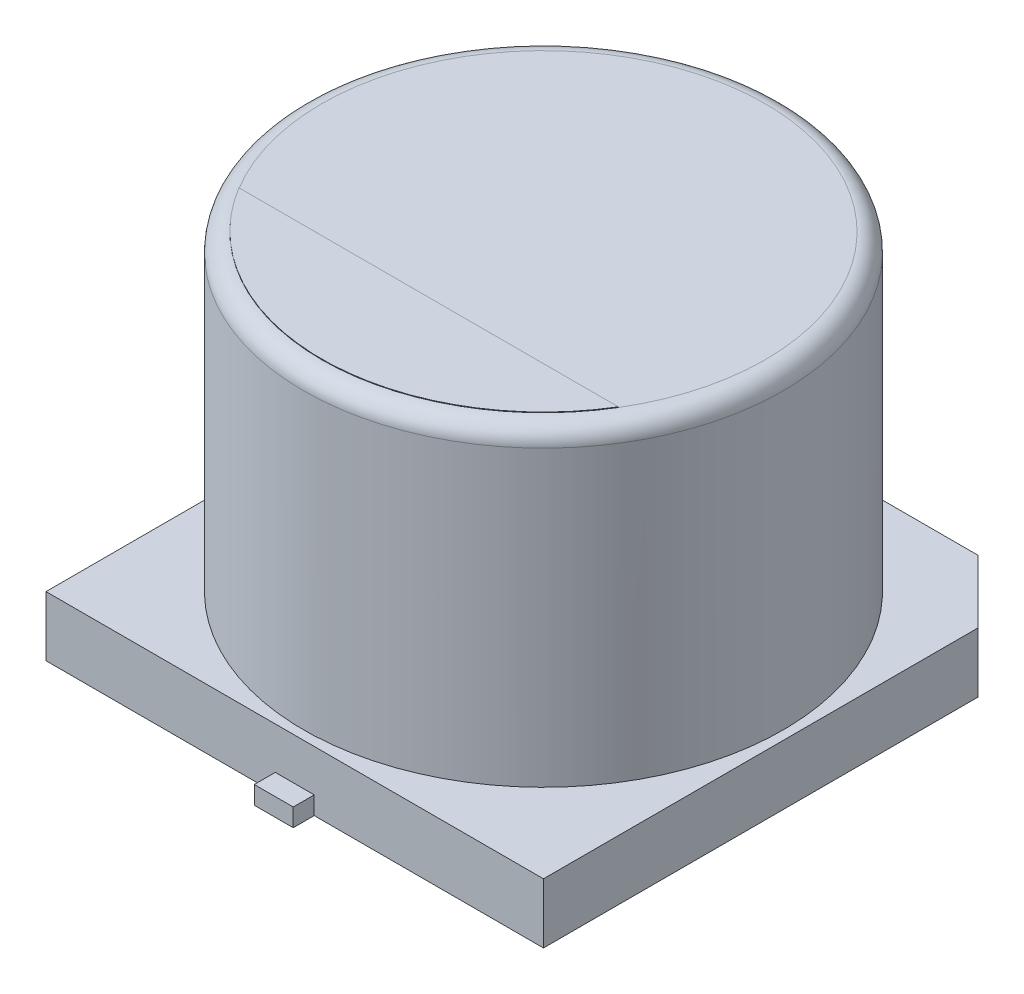
ISO-10303-21;
HEADER;
FILE_DESCRIPTION(('STEP AP214'),'2;1');
FILE_NAME('part.step','',(''),(''),'','','');
FILE_SCHEMA(('AUTOMOTIVE_DESIGN { 1 0 10303 214 1 1 1 1 }'));
ENDSEC;
DATA;
#1=APPLICATION_CONTEXT('core data for automotive mechanical design processes');
#2=APPLICATION_PROTOCOL_DEFINITION('international standard','automotive_design',2000,#1);
#3=PRODUCT_CONTEXT('',#1,'mechanical');
#4=PRODUCT('Part','Part','',(#3));
#5=PRODUCT_RELATED_PRODUCT_CATEGORY('part','',(#4));
#6=PRODUCT_DEFINITION_FORMATION('','',#4);
#7=PRODUCT_DEFINITION_CONTEXT('part definition',#1,'design');
#8=PRODUCT_DEFINITION('design','',#6,#7);
#9=PRODUCT_DEFINITION_SHAPE('','',#8);
#10=(LENGTH_UNIT() NAMED_UNIT(*) SI_UNIT(.MILLI.,.METRE.));
#11=(NAMED_UNIT(*) PLANE_ANGLE_UNIT() SI_UNIT($,.RADIAN.));
#12=(NAMED_UNIT(*) SI_UNIT($,.STERADIAN.) SOLID_ANGLE_UNIT());
#13=UNCERTAINTY_MEASURE_WITH_UNIT(LENGTH_MEASURE(1.E-05),#10,'distance_accuracy_value','');
#14=(GEOMETRIC_REPRESENTATION_CONTEXT(3) GLOBAL_UNCERTAINTY_ASSIGNED_CONTEXT((#13)) GLOBAL_UNIT_ASSIGNED_CONTEXT((#10,
#11,#12)) REPRESENTATION_CONTEXT('',''));
#15=CARTESIAN_POINT('',(0.,0.,0.));
#16=DIRECTION('',(0.,0.,1.));
#17=DIRECTION('',(1.,0.,0.));
#18=AXIS2_PLACEMENT_3D('',#15,#16,#17);
#19=CARTESIAN_POINT('',(0.,6.2,0.));
#20=DIRECTION('',(0.,1.,0.));
#21=DIRECTION('',(0.,0.,1.));
#22=AXIS2_PLACEMENT_3D('',#19,#20,#21);
#23=PLANE('',#22);
#24=CARTESIAN_POINT('',(0.,6.2,0.));
#25=DIRECTION('',(0.,1.,0.));
#26=DIRECTION('',(0.,0.,1.));
#27=AXIS2_PLACEMENT_3D('',#24,#25,#26);
#28=CIRCLE('',#27,3.7);
#29=CARTESIAN_POINT('',(3.16503381707792,6.2,1.91639268855659));
#30=VERTEX_POINT('',#29);
#31=CARTESIAN_POINT('',(-3.16503381707792,6.2,1.91639268855659));
#32=VERTEX_POINT('',#31);
#33=EDGE_CURVE('E221',#30,#32,#28,.T.);
#34=ORIENTED_EDGE('',*,*,#33,.T.);
#35=DIRECTION('',(-1.,0.,0.));
#36=VECTOR('',#35,1.);
#37=CARTESIAN_POINT('',(-3.16503381707792,6.2,1.91639268855659));
#38=LINE('',#37,#36);
#39=EDGE_CURVE('E159',#30,#32,#38,.T.);
#40=ORIENTED_EDGE('',*,*,#39,.F.);
#41=EDGE_LOOP('',(#34,#40));
#42=FACE_BOUND('',#41,.T.);
#43=ADVANCED_FACE('F33',(#42),#23,.T.);
#44=CARTESIAN_POINT('',(-3.1,1.,-4.15));
#45=DIRECTION('',(0.,0.,1.));
#46=DIRECTION('',(1.,0.,0.));
#47=AXIS2_PLACEMENT_3D('',#44,#45,#46);
#48=PLANE('',#47);
#49=DIRECTION('',(0.,-1.,0.));
#50=VECTOR('',#49,1.);
#51=CARTESIAN_POINT('',(0.325,1.,-4.15));
#52=LINE('',#51,#50);
#53=CARTESIAN_POINT('',(0.325,0.3,-4.15));
#54=VERTEX_POINT('',#53);
#55=CARTESIAN_POINT('',(0.324999999999999,0.,-4.15));
#56=VERTEX_POINT('',#55);
#57=EDGE_CURVE('E188',#54,#56,#52,.T.);
#58=ORIENTED_EDGE('',*,*,#57,.F.);
#59=DIRECTION('',(-1.,0.,0.));
#60=VECTOR('',#59,1.);
#61=CARTESIAN_POINT('',(-3.1,0.3,-4.15));
#62=LINE('',#61,#60);
#63=CARTESIAN_POINT('',(-0.325,0.3,-4.15));
#64=VERTEX_POINT('',#63);
#65=EDGE_CURVE('E11',#54,#64,#62,.T.);
#66=ORIENTED_EDGE('',*,*,#65,.T.);
#67=DIRECTION('',(0.,1.,0.));
#68=VECTOR('',#67,1.);
#69=CARTESIAN_POINT('',(-0.325,1.,-4.15));
#70=LINE('',#69,#68);
#71=CARTESIAN_POINT('',(-0.325,0.,-4.15));
#72=VERTEX_POINT('',#71);
#73=EDGE_CURVE('E186',#72,#64,#70,.T.);
#74=ORIENTED_EDGE('',*,*,#73,.F.);
#75=DIRECTION('',(-1.,0.,0.));
#76=VECTOR('',#75,1.);
#77=CARTESIAN_POINT('',(-3.1,0.,-4.15));
#78=LINE('',#77,#76);
#79=CARTESIAN_POINT('',(-3.1,0.,-4.15));
#80=VERTEX_POINT('',#79);
#81=EDGE_CURVE('E242',#72,#80,#78,.T.);
#82=ORIENTED_EDGE('',*,*,#81,.T.);
#83=DIRECTION('',(0.,-1.,0.));
#84=VECTOR('',#83,1.);
#85=CARTESIAN_POINT('',(-3.1,1.,-4.15));
#86=LINE('',#85,#84);
#87=CARTESIAN_POINT('',(-3.1,1.,-4.15));
#88=VERTEX_POINT('',#87);
#89=EDGE_CURVE('E259',#88,#80,#86,.T.);
#90=ORIENTED_EDGE('',*,*,#89,.F.);
#91=DIRECTION('',(-1.,0.,0.));
#92=VECTOR('',#91,1.);
#93=CARTESIAN_POINT('',(-3.1,1.,-4.15));
#94=LINE('',#93,#92);
#95=CARTESIAN_POINT('',(3.1,1.,-4.15));
#96=VERTEX_POINT('',#95);
#97=EDGE_CURVE('E229',#96,#88,#94,.T.);
#98=ORIENTED_EDGE('',*,*,#97,.F.);
#99=DIRECTION('',(0.,-1.,0.));
#100=VECTOR('',#99,1.);
#101=CARTESIAN_POINT('',(3.1,1.,-4.15));
#102=LINE('',#101,#100);
#103=CARTESIAN_POINT('',(3.1,0.,-4.15));
#104=VERTEX_POINT('',#103);
#105=EDGE_CURVE('E262',#96,#104,#102,.T.);
#106=ORIENTED_EDGE('',*,*,#105,.T.);
#107=EDGE_CURVE('E243',#104,#56,#78,.T.);
#108=ORIENTED_EDGE('',*,*,#107,.T.);
#109=EDGE_LOOP('',(#58,#66,#74,#82,#90,#98,#106,#108));
#110=FACE_BOUND('',#109,.T.);
#111=ADVANCED_FACE('F319',(#110),#48,.F.);
#112=CARTESIAN_POINT('',(4.15,1.,4.15));
#113=DIRECTION('',(0.,0.,-1.));
#114=DIRECTION('',(-1.,0.,0.));
#115=AXIS2_PLACEMENT_3D('',#112,#113,#114);
#116=PLANE('',#115);
#117=DIRECTION('',(0.,-1.,0.));
#118=VECTOR('',#117,1.);
#119=CARTESIAN_POINT('',(-0.325000000000001,1.,4.15));
#120=LINE('',#119,#118);
#121=CARTESIAN_POINT('',(-0.325000000000001,0.3,4.15));
#122=VERTEX_POINT('',#121);
#123=CARTESIAN_POINT('',(-0.324999999999998,0.,4.15));
#124=VERTEX_POINT('',#123);
#125=EDGE_CURVE('E214',#122,#124,#120,.T.);
#126=ORIENTED_EDGE('',*,*,#125,.F.);
#127=DIRECTION('',(-1.,0.,0.));
#128=VECTOR('',#127,1.);
#129=CARTESIAN_POINT('',(4.15,0.3,4.15));
#130=LINE('',#129,#128);
#131=CARTESIAN_POINT('',(0.325,0.3,4.15));
#132=VERTEX_POINT('',#131);
#133=EDGE_CURVE('E41',#132,#122,#130,.T.);
#134=ORIENTED_EDGE('',*,*,#133,.F.);
#135=DIRECTION('',(0.,1.,0.));
#136=VECTOR('',#135,1.);
#137=CARTESIAN_POINT('',(0.325,1.,4.15));
#138=LINE('',#137,#136);
#139=CARTESIAN_POINT('',(0.325,0.,4.15));
#140=VERTEX_POINT('',#139);
#141=EDGE_CURVE('E211',#140,#132,#138,.T.);
#142=ORIENTED_EDGE('',*,*,#141,.F.);
#143=DIRECTION('',(1.,0.,0.));
#144=VECTOR('',#143,1.);
#145=CARTESIAN_POINT('',(4.15,0.,4.15));
#146=LINE('',#145,#144);
#147=CARTESIAN_POINT('',(4.15,0.,4.15));
#148=VERTEX_POINT('',#147);
#149=EDGE_CURVE('E249',#140,#148,#146,.T.);
#150=ORIENTED_EDGE('',*,*,#149,.T.);
#151=DIRECTION('',(0.,-1.,0.));
#152=VECTOR('',#151,1.);
#153=CARTESIAN_POINT('',(4.15,1.,4.15));
#154=LINE('',#153,#152);
#155=CARTESIAN_POINT('',(4.15,1.,4.15));
#156=VERTEX_POINT('',#155);
#157=EDGE_CURVE('E237',#156,#148,#154,.T.);
#158=ORIENTED_EDGE('',*,*,#157,.F.);
#159=DIRECTION('',(1.,0.,0.));
#160=VECTOR('',#159,1.);
#161=CARTESIAN_POINT('',(4.15,1.,4.15));
#162=LINE('',#161,#160);
#163=CARTESIAN_POINT('',(-4.15,1.,4.15));
#164=VERTEX_POINT('',#163);
#165=EDGE_CURVE('E235',#164,#156,#162,.T.);
#166=ORIENTED_EDGE('',*,*,#165,.F.);
#167=DIRECTION('',(0.,-1.,0.));
#168=VECTOR('',#167,1.);
#169=CARTESIAN_POINT('',(-4.15,1.,4.15));
#170=LINE('',#169,#168);
#171=CARTESIAN_POINT('',(-4.15,0.,4.15));
#172=VERTEX_POINT('',#171);
#173=EDGE_CURVE('E253',#164,#172,#170,.T.);
#174=ORIENTED_EDGE('',*,*,#173,.T.);
#175=EDGE_CURVE('E227',#172,#124,#146,.T.);
#176=ORIENTED_EDGE('',*,*,#175,.T.);
#177=EDGE_LOOP('',(#126,#134,#142,#150,#158,#166,#174,#176));
#178=FACE_BOUND('',#177,.T.);
#179=ADVANCED_FACE('F289',(#178),#116,.F.);
#180=CARTESIAN_POINT('',(4.15,1.,-3.1));
#181=DIRECTION('',(-1.,0.,0.));
#182=DIRECTION('',(0.,0.,1.));
#183=AXIS2_PLACEMENT_3D('',#180,#181,#182);
#184=PLANE('',#183);
#185=DIRECTION('',(0.,0.,-1.));
#186=VECTOR('',#185,1.);
#187=CARTESIAN_POINT('',(4.15,0.,-3.1));
#188=LINE('',#187,#186);
#189=CARTESIAN_POINT('',(4.15,0.,-3.1));
#190=VERTEX_POINT('',#189);
#191=EDGE_CURVE('E217',#148,#190,#188,.T.);
#192=ORIENTED_EDGE('',*,*,#191,.T.);
#193=DIRECTION('',(0.,-1.,0.));
#194=VECTOR('',#193,1.);
#195=CARTESIAN_POINT('',(4.15,1.,-3.1));
#196=LINE('',#195,#194);
#197=CARTESIAN_POINT('',(4.15,1.,-3.1));
#198=VERTEX_POINT('',#197);
#199=EDGE_CURVE('E222',#198,#190,#196,.T.);
#200=ORIENTED_EDGE('',*,*,#199,.F.);
#201=DIRECTION('',(0.,0.,-1.));
#202=VECTOR('',#201,1.);
#203=CARTESIAN_POINT('',(4.15,1.,-3.1));
#204=LINE('',#203,#202);
#205=EDGE_CURVE('E223',#156,#198,#204,.T.);
#206=ORIENTED_EDGE('',*,*,#205,.F.);
#207=ORIENTED_EDGE('',*,*,#157,.T.);
#208=EDGE_LOOP('',(#192,#200,#206,#207));
#209=FACE_BOUND('',#208,.T.);
#210=ADVANCED_FACE('F296',(#209),#184,.F.);
#211=CARTESIAN_POINT('',(3.1,1.,-4.15));
#212=DIRECTION('',(-0.707106781186548,0.,0.707106781186547));
#213=DIRECTION('',(0.707106781186547,0.,0.707106781186548));
#214=AXIS2_PLACEMENT_3D('',#211,#212,#213);
#215=PLANE('',#214);
#216=DIRECTION('',(-0.707106781186547,0.,-0.707106781186548));
#217=VECTOR('',#216,1.);
#218=CARTESIAN_POINT('',(3.1,0.,-4.15));
#219=LINE('',#218,#217);
#220=EDGE_CURVE('E240',#190,#104,#219,.T.);
#221=ORIENTED_EDGE('',*,*,#220,.T.);
#222=ORIENTED_EDGE('',*,*,#105,.F.);
#223=DIRECTION('',(-0.707106781186547,0.,-0.707106781186548));
#224=VECTOR('',#223,1.);
#225=CARTESIAN_POINT('',(3.1,1.,-4.15));
#226=LINE('',#225,#224);
#227=EDGE_CURVE('E226',#198,#96,#226,.T.);
#228=ORIENTED_EDGE('',*,*,#227,.F.);
#229=ORIENTED_EDGE('',*,*,#199,.T.);
#230=EDGE_LOOP('',(#221,#222,#228,#229));
#231=FACE_BOUND('',#230,.T.);
#232=ADVANCED_FACE('F303',(#231),#215,.F.);
#233=CARTESIAN_POINT('',(-4.15,1.,-3.1));
#234=DIRECTION('',(0.707106781186548,0.,0.707106781186547));
#235=DIRECTION('',(0.707106781186547,0.,-0.707106781186548));
#236=AXIS2_PLACEMENT_3D('',#233,#234,#235);
#237=PLANE('',#236);
#238=DIRECTION('',(-0.707106781186547,0.,0.707106781186548));
#239=VECTOR('',#238,1.);
#240=CARTESIAN_POINT('',(-4.15,0.,-3.1));
#241=LINE('',#240,#239);
#242=CARTESIAN_POINT('',(-4.15,0.,-3.1));
#243=VERTEX_POINT('',#242);
#244=EDGE_CURVE('E245',#80,#243,#241,.T.);
#245=ORIENTED_EDGE('',*,*,#244,.T.);
#246=DIRECTION('',(0.,-1.,0.));
#247=VECTOR('',#246,1.);
#248=CARTESIAN_POINT('',(-4.15,1.,-3.1));
#249=LINE('',#248,#247);
#250=CARTESIAN_POINT('',(-4.15,1.,-3.1));
#251=VERTEX_POINT('',#250);
#252=EDGE_CURVE('E256',#251,#243,#249,.T.);
#253=ORIENTED_EDGE('',*,*,#252,.F.);
#254=DIRECTION('',(-0.707106781186547,0.,0.707106781186548));
#255=VECTOR('',#254,1.);
#256=CARTESIAN_POINT('',(-4.15,1.,-3.1));
#257=LINE('',#256,#255);
#258=EDGE_CURVE('E231',#88,#251,#257,.T.);
#259=ORIENTED_EDGE('',*,*,#258,.F.);
#260=ORIENTED_EDGE('',*,*,#89,.T.);
#261=EDGE_LOOP('',(#245,#253,#259,#260));
#262=FACE_BOUND('',#261,.T.);
#263=ADVANCED_FACE('F317',(#262),#237,.F.);
#264=CARTESIAN_POINT('',(-4.15,1.,4.15));
#265=DIRECTION('',(1.,0.,0.));
#266=DIRECTION('',(0.,0.,-1.));
#267=AXIS2_PLACEMENT_3D('',#264,#265,#266);
#268=PLANE('',#267);
#269=DIRECTION('',(0.,0.,1.));
#270=VECTOR('',#269,1.);
#271=CARTESIAN_POINT('',(-4.15,0.,4.15));
#272=LINE('',#271,#270);
#273=EDGE_CURVE('E247',#243,#172,#272,.T.);
#274=ORIENTED_EDGE('',*,*,#273,.T.);
#275=ORIENTED_EDGE('',*,*,#173,.F.);
#276=DIRECTION('',(0.,0.,1.));
#277=VECTOR('',#276,1.);
#278=CARTESIAN_POINT('',(-4.15,1.,4.15));
#279=LINE('',#278,#277);
#280=EDGE_CURVE('E233',#251,#164,#279,.T.);
#281=ORIENTED_EDGE('',*,*,#280,.F.);
#282=ORIENTED_EDGE('',*,*,#252,.T.);
#283=EDGE_LOOP('',(#274,#275,#281,#282));
#284=FACE_BOUND('',#283,.T.);
#285=ADVANCED_FACE('F313',(#284),#268,.F.);
#286=CARTESIAN_POINT('',(0.,1.,0.));
#287=DIRECTION('',(0.,-1.,0.));
#288=DIRECTION('',(0.,0.,-1.));
#289=AXIS2_PLACEMENT_3D('',#286,#287,#288);
#290=PLANE('',#289);
#291=CARTESIAN_POINT('',(0.,1.,0.));
#292=DIRECTION('',(0.,-1.,0.));
#293=DIRECTION('',(0.,0.,-1.));
#294=AXIS2_PLACEMENT_3D('',#291,#292,#293);
#295=CIRCLE('',#294,4.);
#296=CARTESIAN_POINT('',(0.,1.,-4.));
#297=VERTEX_POINT('',#296);
#298=EDGE_CURVE('E218',#297,#297,#295,.F.);
#299=ORIENTED_EDGE('',*,*,#298,.F.);
#300=EDGE_LOOP('',(#299));
#301=FACE_BOUND('',#300,.T.);
#302=ORIENTED_EDGE('',*,*,#205,.T.);
#303=ORIENTED_EDGE('',*,*,#227,.T.);
#304=ORIENTED_EDGE('',*,*,#97,.T.);
#305=ORIENTED_EDGE('',*,*,#258,.T.);
#306=ORIENTED_EDGE('',*,*,#280,.T.);
#307=ORIENTED_EDGE('',*,*,#165,.T.);
#308=EDGE_LOOP('',(#302,#303,#304,#305,#306,#307));
#309=FACE_BOUND('',#308,.T.);
#310=ADVANCED_FACE('F306',(#301,#309),#290,.F.);
#311=CARTESIAN_POINT('',(0.,0.,0.));
#312=DIRECTION('',(0.,-1.,0.));
#313=DIRECTION('',(0.,0.,-1.));
#314=AXIS2_PLACEMENT_3D('',#311,#312,#313);
#315=PLANE('',#314);
#316=ORIENTED_EDGE('',*,*,#81,.F.);
#317=DIRECTION('',(0.,0.,1.));
#318=VECTOR('',#317,1.);
#319=CARTESIAN_POINT('',(-0.325,0.,-1.1));
#320=LINE('',#319,#318);
#321=CARTESIAN_POINT('',(-0.325,0.,-4.5));
#322=VERTEX_POINT('',#321);
#323=EDGE_CURVE('E172',#322,#72,#320,.T.);
#324=ORIENTED_EDGE('',*,*,#323,.F.);
#325=DIRECTION('',(-1.,0.,0.));
#326=VECTOR('',#325,1.);
#327=CARTESIAN_POINT('',(0.325,0.,-4.5));
#328=LINE('',#327,#326);
#329=CARTESIAN_POINT('',(0.325,0.,-4.5));
#330=VERTEX_POINT('',#329);
#331=EDGE_CURVE('E164',#330,#322,#328,.T.);
#332=ORIENTED_EDGE('',*,*,#331,.F.);
#333=DIRECTION('',(0.,0.,-1.));
#334=VECTOR('',#333,1.);
#335=CARTESIAN_POINT('',(0.325,0.,-1.1));
#336=LINE('',#335,#334);
#337=EDGE_CURVE('E162',#56,#330,#336,.T.);
#338=ORIENTED_EDGE('',*,*,#337,.F.);
#339=ORIENTED_EDGE('',*,*,#107,.F.);
#340=ORIENTED_EDGE('',*,*,#220,.F.);
#341=ORIENTED_EDGE('',*,*,#191,.F.);
#342=ORIENTED_EDGE('',*,*,#149,.F.);
#343=DIRECTION('',(0.,0.,-1.));
#344=VECTOR('',#343,1.);
#345=CARTESIAN_POINT('',(0.325,0.,1.1));
#346=LINE('',#345,#344);
#347=CARTESIAN_POINT('',(0.325,0.,4.5));
#348=VERTEX_POINT('',#347);
#349=EDGE_CURVE('E195',#348,#140,#346,.T.);
#350=ORIENTED_EDGE('',*,*,#349,.F.);
#351=DIRECTION('',(1.,0.,0.));
#352=VECTOR('',#351,1.);
#353=CARTESIAN_POINT('',(0.325,0.,4.5));
#354=LINE('',#353,#352);
#355=CARTESIAN_POINT('',(-0.325,0.,4.5));
#356=VERTEX_POINT('',#355);
#357=EDGE_CURVE('E202',#356,#348,#354,.T.);
#358=ORIENTED_EDGE('',*,*,#357,.F.);
#359=DIRECTION('',(0.,0.,1.));
#360=VECTOR('',#359,1.);
#361=CARTESIAN_POINT('',(-0.325,0.,1.1));
#362=LINE('',#361,#360);
#363=EDGE_CURVE('E191',#124,#356,#362,.T.);
#364=ORIENTED_EDGE('',*,*,#363,.F.);
#365=ORIENTED_EDGE('',*,*,#175,.F.);
#366=ORIENTED_EDGE('',*,*,#273,.F.);
#367=ORIENTED_EDGE('',*,*,#244,.F.);
#368=EDGE_LOOP('',(#316,#324,#332,#338,#339,#340,#341,#342,#350,#358,#364,#365,#366,#367));
#369=FACE_BOUND('',#368,.T.);
#370=ADVANCED_FACE('F298',(#369),#315,.T.);
#371=CARTESIAN_POINT('',(0.,6.2,0.));
#372=DIRECTION('',(0.,-1.,0.));
#373=DIRECTION('',(0.,0.,-1.));
#374=AXIS2_PLACEMENT_3D('',#371,#372,#373);
#375=CYLINDRICAL_SURFACE('',#374,4.);
#376=CARTESIAN_POINT('',(0.,5.9,0.));
#377=DIRECTION('',(0.,1.,0.));
#378=DIRECTION('',(0.,0.,1.));
#379=AXIS2_PLACEMENT_3D('',#376,#377,#378);
#380=CIRCLE('',#379,4.);
#381=CARTESIAN_POINT('',(0.,5.9,4.));
#382=VERTEX_POINT('',#381);
#383=EDGE_CURVE('E268',#382,#382,#380,.F.);
#384=ORIENTED_EDGE('',*,*,#383,.T.);
#385=EDGE_LOOP('',(#384));
#386=FACE_BOUND('',#385,.T.);
#387=ORIENTED_EDGE('',*,*,#298,.T.);
#388=EDGE_LOOP('',(#387));
#389=FACE_BOUND('',#388,.T.);
#390=ADVANCED_FACE('F354',(#386,#389),#375,.T.);
#391=CARTESIAN_POINT('',(0.,5.9,0.));
#392=DIRECTION('',(0.,1.,0.));
#393=DIRECTION('',(0.,0.,1.));
#394=AXIS2_PLACEMENT_3D('',#391,#392,#393);
#395=TOROIDAL_SURFACE('',#394,3.7,0.3);
#396=ORIENTED_EDGE('',*,*,#383,.F.);
#397=EDGE_LOOP('',(#396));
#398=FACE_BOUND('',#397,.T.);
#399=ORIENTED_EDGE('',*,*,#33,.F.);
#400=CARTESIAN_POINT('',(0.,6.2,0.));
#401=DIRECTION('',(0.,1.,0.));
#402=DIRECTION('',(0.,0.,1.));
#403=AXIS2_PLACEMENT_3D('',#400,#401,#402);
#404=CIRCLE('',#403,3.7);
#405=EDGE_CURVE('E47',#32,#30,#404,.T.);
#406=ORIENTED_EDGE('',*,*,#405,.F.);
#407=EDGE_LOOP('',(#399,#406));
#408=FACE_BOUND('',#407,.T.);
#409=ADVANCED_FACE('F35',(#398,#408),#395,.T.);
#410=CARTESIAN_POINT('',(0.,0.3,0.));
#411=DIRECTION('',(0.,-1.,0.));
#412=DIRECTION('',(0.,0.,-1.));
#413=AXIS2_PLACEMENT_3D('',#410,#411,#412);
#414=PLANE('',#413);
#415=DIRECTION('',(0.,0.,-1.));
#416=VECTOR('',#415,1.);
#417=CARTESIAN_POINT('',(0.325,0.3,1.1));
#418=LINE('',#417,#416);
#419=CARTESIAN_POINT('',(0.325,0.3,4.5));
#420=VERTEX_POINT('',#419);
#421=EDGE_CURVE('E197',#420,#132,#418,.T.);
#422=ORIENTED_EDGE('',*,*,#421,.T.);
#423=ORIENTED_EDGE('',*,*,#133,.T.);
#424=DIRECTION('',(0.,0.,1.));
#425=VECTOR('',#424,1.);
#426=CARTESIAN_POINT('',(-0.325,0.3,1.1));
#427=LINE('',#426,#425);
#428=CARTESIAN_POINT('',(-0.325,0.3,4.5));
#429=VERTEX_POINT('',#428);
#430=EDGE_CURVE('E192',#122,#429,#427,.T.);
#431=ORIENTED_EDGE('',*,*,#430,.T.);
#432=DIRECTION('',(1.,0.,0.));
#433=VECTOR('',#432,1.);
#434=CARTESIAN_POINT('',(0.325,0.3,4.5));
#435=LINE('',#434,#433);
#436=EDGE_CURVE('E194',#429,#420,#435,.T.);
#437=ORIENTED_EDGE('',*,*,#436,.T.);
#438=EDGE_LOOP('',(#422,#423,#431,#437));
#439=FACE_BOUND('',#438,.T.);
#440=ADVANCED_FACE('F273',(#439),#414,.F.);
#441=CARTESIAN_POINT('',(-0.325,0.3,1.1));
#442=DIRECTION('',(1.,0.,0.));
#443=DIRECTION('',(0.,0.,-1.));
#444=AXIS2_PLACEMENT_3D('',#441,#442,#443);
#445=PLANE('',#444);
#446=ORIENTED_EDGE('',*,*,#430,.F.);
#447=ORIENTED_EDGE('',*,*,#125,.T.);
#448=ORIENTED_EDGE('',*,*,#363,.T.);
#449=DIRECTION('',(0.,-1.,0.));
#450=VECTOR('',#449,1.);
#451=CARTESIAN_POINT('',(-0.325,0.3,4.5));
#452=LINE('',#451,#450);
#453=EDGE_CURVE('E208',#429,#356,#452,.T.);
#454=ORIENTED_EDGE('',*,*,#453,.F.);
#455=EDGE_LOOP('',(#446,#447,#448,#454));
#456=FACE_BOUND('',#455,.T.);
#457=ADVANCED_FACE('F280',(#456),#445,.F.);
#458=CARTESIAN_POINT('',(0.325,0.3,1.1));
#459=DIRECTION('',(-1.,0.,0.));
#460=DIRECTION('',(0.,0.,1.));
#461=AXIS2_PLACEMENT_3D('',#458,#459,#460);
#462=PLANE('',#461);
#463=ORIENTED_EDGE('',*,*,#349,.T.);
#464=ORIENTED_EDGE('',*,*,#141,.T.);
#465=ORIENTED_EDGE('',*,*,#421,.F.);
#466=DIRECTION('',(0.,-1.,0.));
#467=VECTOR('',#466,1.);
#468=CARTESIAN_POINT('',(0.325,0.3,4.5));
#469=LINE('',#468,#467);
#470=EDGE_CURVE('E200',#420,#348,#469,.T.);
#471=ORIENTED_EDGE('',*,*,#470,.T.);
#472=EDGE_LOOP('',(#463,#464,#465,#471));
#473=FACE_BOUND('',#472,.T.);
#474=ADVANCED_FACE('F288',(#473),#462,.F.);
#475=CARTESIAN_POINT('',(0.325,0.3,4.5));
#476=DIRECTION('',(0.,0.,-1.));
#477=DIRECTION('',(-1.,0.,0.));
#478=AXIS2_PLACEMENT_3D('',#475,#476,#477);
#479=PLANE('',#478);
#480=ORIENTED_EDGE('',*,*,#357,.T.);
#481=ORIENTED_EDGE('',*,*,#470,.F.);
#482=ORIENTED_EDGE('',*,*,#436,.F.);
#483=ORIENTED_EDGE('',*,*,#453,.T.);
#484=EDGE_LOOP('',(#480,#481,#482,#483));
#485=FACE_BOUND('',#484,.T.);
#486=ADVANCED_FACE('F284',(#485),#479,.F.);
#487=CARTESIAN_POINT('',(0.,0.3,0.));
#488=DIRECTION('',(0.,1.,0.));
#489=DIRECTION('',(0.,0.,1.));
#490=AXIS2_PLACEMENT_3D('',#487,#488,#489);
#491=PLANE('',#490);
#492=ORIENTED_EDGE('',*,*,#65,.F.);
#493=DIRECTION('',(0.,0.,-1.));
#494=VECTOR('',#493,1.);
#495=CARTESIAN_POINT('',(0.325,0.3,-1.1));
#496=LINE('',#495,#494);
#497=CARTESIAN_POINT('',(0.325,0.3,-4.5));
#498=VERTEX_POINT('',#497);
#499=EDGE_CURVE('E169',#54,#498,#496,.T.);
#500=ORIENTED_EDGE('',*,*,#499,.T.);
#501=DIRECTION('',(-1.,0.,0.));
#502=VECTOR('',#501,1.);
#503=CARTESIAN_POINT('',(0.325,0.3,-4.5));
#504=LINE('',#503,#502);
#505=CARTESIAN_POINT('',(-0.325,0.3,-4.5));
#506=VERTEX_POINT('',#505);
#507=EDGE_CURVE('E171',#498,#506,#504,.T.);
#508=ORIENTED_EDGE('',*,*,#507,.T.);
#509=DIRECTION('',(0.,0.,1.));
#510=VECTOR('',#509,1.);
#511=CARTESIAN_POINT('',(-0.325,0.3,-1.1));
#512=LINE('',#511,#510);
#513=EDGE_CURVE('E174',#506,#64,#512,.T.);
#514=ORIENTED_EDGE('',*,*,#513,.T.);
#515=EDGE_LOOP('',(#492,#500,#508,#514));
#516=FACE_BOUND('',#515,.T.);
#517=ADVANCED_FACE('F334',(#516),#491,.T.);
#518=CARTESIAN_POINT('',(0.325,0.3,-1.1));
#519=DIRECTION('',(-1.,0.,0.));
#520=DIRECTION('',(0.,0.,1.));
#521=AXIS2_PLACEMENT_3D('',#518,#519,#520);
#522=PLANE('',#521);
#523=ORIENTED_EDGE('',*,*,#499,.F.);
#524=ORIENTED_EDGE('',*,*,#57,.T.);
#525=ORIENTED_EDGE('',*,*,#337,.T.);
#526=DIRECTION('',(0.,-1.,0.));
#527=VECTOR('',#526,1.);
#528=CARTESIAN_POINT('',(0.325,0.3,-4.5));
#529=LINE('',#528,#527);
#530=EDGE_CURVE('E183',#498,#330,#529,.T.);
#531=ORIENTED_EDGE('',*,*,#530,.F.);
#532=EDGE_LOOP('',(#523,#524,#525,#531));
#533=FACE_BOUND('',#532,.T.);
#534=ADVANCED_FACE('F332',(#533),#522,.F.);
#535=CARTESIAN_POINT('',(-0.325,0.3,-1.1));
#536=DIRECTION('',(1.,0.,0.));
#537=DIRECTION('',(0.,0.,-1.));
#538=AXIS2_PLACEMENT_3D('',#535,#536,#537);
#539=PLANE('',#538);
#540=ORIENTED_EDGE('',*,*,#323,.T.);
#541=ORIENTED_EDGE('',*,*,#73,.T.);
#542=ORIENTED_EDGE('',*,*,#513,.F.);
#543=DIRECTION('',(0.,-1.,0.));
#544=VECTOR('',#543,1.);
#545=CARTESIAN_POINT('',(-0.325,0.3,-4.5));
#546=LINE('',#545,#544);
#547=EDGE_CURVE('E176',#506,#322,#546,.T.);
#548=ORIENTED_EDGE('',*,*,#547,.T.);
#549=EDGE_LOOP('',(#540,#541,#542,#548));
#550=FACE_BOUND('',#549,.T.);
#551=ADVANCED_FACE('F323',(#550),#539,.F.);
#552=CARTESIAN_POINT('',(0.325,0.3,-4.5));
#553=DIRECTION('',(0.,0.,1.));
#554=DIRECTION('',(1.,0.,0.));
#555=AXIS2_PLACEMENT_3D('',#552,#553,#554);
#556=PLANE('',#555);
#557=ORIENTED_EDGE('',*,*,#331,.T.);
#558=ORIENTED_EDGE('',*,*,#547,.F.);
#559=ORIENTED_EDGE('',*,*,#507,.F.);
#560=ORIENTED_EDGE('',*,*,#530,.T.);
#561=EDGE_LOOP('',(#557,#558,#559,#560));
#562=FACE_BOUND('',#561,.T.);
#563=ADVANCED_FACE('F328',(#562),#556,.F.);
#564=CARTESIAN_POINT('',(0.,6.21,0.));
#565=DIRECTION('',(0.,-1.,0.));
#566=DIRECTION('',(0.,0.,-1.));
#567=AXIS2_PLACEMENT_3D('',#564,#565,#566);
#568=CYLINDRICAL_SURFACE('',#567,3.7);
#569=ORIENTED_EDGE('',*,*,#405,.T.);
#570=DIRECTION('',(0.,-1.,0.));
#571=VECTOR('',#570,1.);
#572=CARTESIAN_POINT('',(3.16503381707792,6.21,1.91639268855659));
#573=LINE('',#572,#571);
#574=CARTESIAN_POINT('',(3.16503381707792,6.21,1.91639268855659));
#575=VERTEX_POINT('',#574);
#576=EDGE_CURVE('E150',#575,#30,#573,.T.);
#577=ORIENTED_EDGE('',*,*,#576,.F.);
#578=CARTESIAN_POINT('',(0.,6.21,0.));
#579=DIRECTION('',(0.,1.,0.));
#580=DIRECTION('',(0.,0.,1.));
#581=AXIS2_PLACEMENT_3D('',#578,#579,#580);
#582=CIRCLE('',#581,3.7);
#583=CARTESIAN_POINT('',(-3.16503381707792,6.21,1.91639268855659));
#584=VERTEX_POINT('',#583);
#585=EDGE_CURVE('E155',#584,#575,#582,.T.);
#586=ORIENTED_EDGE('',*,*,#585,.F.);
#587=DIRECTION('',(0.,-1.,0.));
#588=VECTOR('',#587,1.);
#589=CARTESIAN_POINT('',(-3.16503381707792,6.21,1.91639268855659));
#590=LINE('',#589,#588);
#591=EDGE_CURVE('E152',#584,#32,#590,.T.);
#592=ORIENTED_EDGE('',*,*,#591,.T.);
#593=EDGE_LOOP('',(#569,#577,#586,#592));
#594=FACE_BOUND('',#593,.T.);
#595=ADVANCED_FACE('F161',(#594),#568,.T.);
#596=CARTESIAN_POINT('',(-3.16503381707792,6.21,1.91639268855659));
#597=DIRECTION('',(0.,0.,1.));
#598=DIRECTION('',(1.,0.,0.));
#599=AXIS2_PLACEMENT_3D('',#596,#597,#598);
#600=PLANE('',#599);
#601=ORIENTED_EDGE('',*,*,#39,.T.);
#602=ORIENTED_EDGE('',*,*,#591,.F.);
#603=DIRECTION('',(-1.,0.,0.));
#604=VECTOR('',#603,1.);
#605=CARTESIAN_POINT('',(-3.16503381707792,6.21,1.91639268855659));
#606=LINE('',#605,#604);
#607=EDGE_CURVE('E145',#575,#584,#606,.T.);
#608=ORIENTED_EDGE('',*,*,#607,.F.);
#609=ORIENTED_EDGE('',*,*,#576,.T.);
#610=EDGE_LOOP('',(#601,#602,#608,#609));
#611=FACE_BOUND('',#610,.T.);
#612=ADVANCED_FACE('F148',(#611),#600,.F.);
#613=CARTESIAN_POINT('',(0.,6.21,0.));
#614=DIRECTION('',(0.,1.,0.));
#615=DIRECTION('',(0.,0.,1.));
#616=AXIS2_PLACEMENT_3D('',#613,#614,#615);
#617=PLANE('',#616);
#618=ORIENTED_EDGE('',*,*,#585,.T.);
#619=ORIENTED_EDGE('',*,*,#607,.T.);
#620=EDGE_LOOP('',(#618,#619));
#621=FACE_BOUND('',#620,.T.);
#622=ADVANCED_FACE('F157',(#621),#617,.T.);
#623=CLOSED_SHELL('',(#43,#111,#179,#210,#232,#263,#285,#310,#370,#390,#409,#440,#457,#474,#486,
#517,#534,#551,#563,#595,#612,#622));
#624=MANIFOLD_SOLID_BREP('B2',#623);
#625=ADVANCED_BREP_SHAPE_REPRESENTATION('',(#18,#624),#14);
#626=SHAPE_DEFINITION_REPRESENTATION(#9,#625);
ENDSEC;
END-ISO-10303-21;
